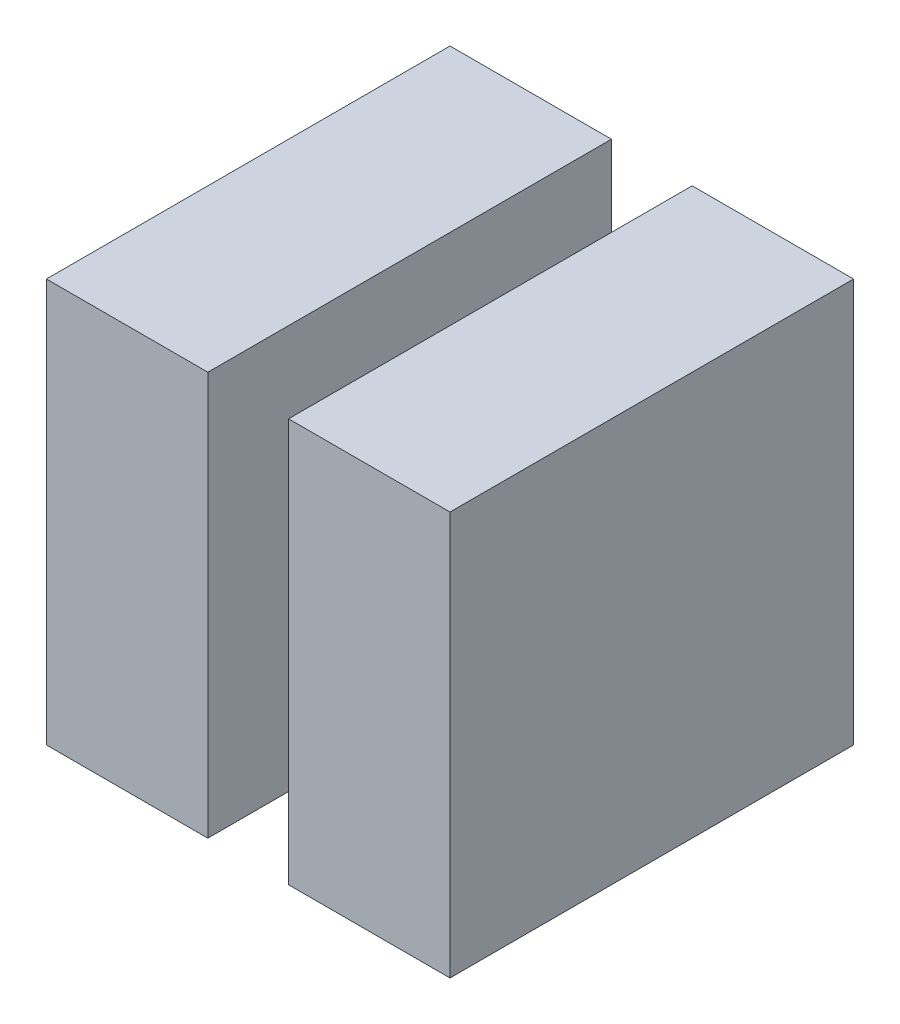
ISO-10303-21;
HEADER;
FILE_DESCRIPTION(('STEP AP214'),'2;1');
FILE_NAME('part.step','',(''),(''),'','','');
FILE_SCHEMA(('AUTOMOTIVE_DESIGN { 1 0 10303 214 1 1 1 1 }'));
ENDSEC;
DATA;
#1=APPLICATION_CONTEXT('core data for automotive mechanical design processes');
#2=APPLICATION_PROTOCOL_DEFINITION('international standard','automotive_design',2000,#1);
#3=PRODUCT_CONTEXT('',#1,'mechanical');
#4=PRODUCT('Part','Part','',(#3));
#5=PRODUCT_RELATED_PRODUCT_CATEGORY('part','',(#4));
#6=PRODUCT_DEFINITION_FORMATION('','',#4);
#7=PRODUCT_DEFINITION_CONTEXT('part definition',#1,'design');
#8=PRODUCT_DEFINITION('design','',#6,#7);
#9=PRODUCT_DEFINITION_SHAPE('','',#8);
#10=(LENGTH_UNIT() NAMED_UNIT(*) SI_UNIT(.MILLI.,.METRE.));
#11=(NAMED_UNIT(*) PLANE_ANGLE_UNIT() SI_UNIT($,.RADIAN.));
#12=(NAMED_UNIT(*) SI_UNIT($,.STERADIAN.) SOLID_ANGLE_UNIT());
#13=UNCERTAINTY_MEASURE_WITH_UNIT(LENGTH_MEASURE(1.E-05),#10,'distance_accuracy_value','');
#14=(GEOMETRIC_REPRESENTATION_CONTEXT(3) GLOBAL_UNCERTAINTY_ASSIGNED_CONTEXT((#13)) GLOBAL_UNIT_ASSIGNED_CONTEXT((#10,
#11,#12)) REPRESENTATION_CONTEXT('',''));
#15=CARTESIAN_POINT('',(0.,0.,0.));
#16=DIRECTION('',(0.,0.,1.));
#17=DIRECTION('',(1.,0.,0.));
#18=AXIS2_PLACEMENT_3D('',#15,#16,#17);
#19=CARTESIAN_POINT('',(30.,0.,50.));
#20=DIRECTION('',(1.,0.,0.));
#21=DIRECTION('',(0.,0.,-1.));
#22=AXIS2_PLACEMENT_3D('',#19,#20,#21);
#23=PLANE('',#22);
#24=DIRECTION('',(0.,-1.,0.));
#25=VECTOR('',#24,1.);
#26=CARTESIAN_POINT('',(30.,0.,0.));
#27=LINE('',#26,#25);
#28=CARTESIAN_POINT('',(30.,50.,0.));
#29=VERTEX_POINT('',#28);
#30=CARTESIAN_POINT('',(30.,0.,0.));
#31=VERTEX_POINT('',#30);
#32=EDGE_CURVE('E125',#29,#31,#27,.T.);
#33=ORIENTED_EDGE('',*,*,#32,.T.);
#34=DIRECTION('',(0.,0.,-1.));
#35=VECTOR('',#34,1.);
#36=CARTESIAN_POINT('',(30.,0.,50.));
#37=LINE('',#36,#35);
#38=CARTESIAN_POINT('',(30.,0.,50.));
#39=VERTEX_POINT('',#38);
#40=EDGE_CURVE('E12',#39,#31,#37,.T.);
#41=ORIENTED_EDGE('',*,*,#40,.F.);
#42=DIRECTION('',(0.,-1.,0.));
#43=VECTOR('',#42,1.);
#44=CARTESIAN_POINT('',(30.,0.,50.));
#45=LINE('',#44,#43);
#46=CARTESIAN_POINT('',(30.,50.,50.));
#47=VERTEX_POINT('',#46);
#48=EDGE_CURVE('E109',#47,#39,#45,.T.);
#49=ORIENTED_EDGE('',*,*,#48,.F.);
#50=DIRECTION('',(0.,0.,-1.));
#51=VECTOR('',#50,1.);
#52=CARTESIAN_POINT('',(30.,50.,50.));
#53=LINE('',#52,#51);
#54=EDGE_CURVE('E121',#47,#29,#53,.T.);
#55=ORIENTED_EDGE('',*,*,#54,.T.);
#56=EDGE_LOOP('',(#33,#41,#49,#55));
#57=FACE_BOUND('',#56,.T.);
#58=ADVANCED_FACE('F57',(#57),#23,.F.);
#59=CARTESIAN_POINT('',(30.,0.,50.));
#60=DIRECTION('',(0.,1.,0.));
#61=DIRECTION('',(0.,0.,1.));
#62=AXIS2_PLACEMENT_3D('',#59,#60,#61);
#63=PLANE('',#62);
#64=DIRECTION('',(1.,0.,0.));
#65=VECTOR('',#64,1.);
#66=CARTESIAN_POINT('',(30.,0.,0.));
#67=LINE('',#66,#65);
#68=CARTESIAN_POINT('',(50.,0.,0.));
#69=VERTEX_POINT('',#68);
#70=EDGE_CURVE('E114',#31,#69,#67,.T.);
#71=ORIENTED_EDGE('',*,*,#70,.T.);
#72=DIRECTION('',(0.,0.,-1.));
#73=VECTOR('',#72,1.);
#74=CARTESIAN_POINT('',(50.,0.,50.));
#75=LINE('',#74,#73);
#76=CARTESIAN_POINT('',(50.,0.,50.));
#77=VERTEX_POINT('',#76);
#78=EDGE_CURVE('E66',#77,#69,#75,.T.);
#79=ORIENTED_EDGE('',*,*,#78,.F.);
#80=DIRECTION('',(1.,0.,0.));
#81=VECTOR('',#80,1.);
#82=CARTESIAN_POINT('',(30.,0.,50.));
#83=LINE('',#82,#81);
#84=EDGE_CURVE('E104',#39,#77,#83,.T.);
#85=ORIENTED_EDGE('',*,*,#84,.F.);
#86=ORIENTED_EDGE('',*,*,#40,.T.);
#87=EDGE_LOOP('',(#71,#79,#85,#86));
#88=FACE_BOUND('',#87,.T.);
#89=ADVANCED_FACE('F113',(#88),#63,.F.);
#90=CARTESIAN_POINT('',(50.,0.,50.));
#91=DIRECTION('',(-1.,0.,0.));
#92=DIRECTION('',(0.,0.,1.));
#93=AXIS2_PLACEMENT_3D('',#90,#91,#92);
#94=PLANE('',#93);
#95=DIRECTION('',(0.,1.,0.));
#96=VECTOR('',#95,1.);
#97=CARTESIAN_POINT('',(50.,0.,0.));
#98=LINE('',#97,#96);
#99=CARTESIAN_POINT('',(50.,50.,0.));
#100=VERTEX_POINT('',#99);
#101=EDGE_CURVE('E91',#69,#100,#98,.T.);
#102=ORIENTED_EDGE('',*,*,#101,.T.);
#103=DIRECTION('',(0.,0.,-1.));
#104=VECTOR('',#103,1.);
#105=CARTESIAN_POINT('',(50.,50.,50.));
#106=LINE('',#105,#104);
#107=CARTESIAN_POINT('',(50.,50.,50.));
#108=VERTEX_POINT('',#107);
#109=EDGE_CURVE('E116',#108,#100,#106,.T.);
#110=ORIENTED_EDGE('',*,*,#109,.F.);
#111=DIRECTION('',(0.,1.,0.));
#112=VECTOR('',#111,1.);
#113=CARTESIAN_POINT('',(50.,0.,50.));
#114=LINE('',#113,#112);
#115=EDGE_CURVE('E107',#77,#108,#114,.T.);
#116=ORIENTED_EDGE('',*,*,#115,.F.);
#117=ORIENTED_EDGE('',*,*,#78,.T.);
#118=EDGE_LOOP('',(#102,#110,#116,#117));
#119=FACE_BOUND('',#118,.T.);
#120=ADVANCED_FACE('F117',(#119),#94,.F.);
#121=CARTESIAN_POINT('',(30.,50.,50.));
#122=DIRECTION('',(0.,-1.,0.));
#123=DIRECTION('',(0.,0.,-1.));
#124=AXIS2_PLACEMENT_3D('',#121,#122,#123);
#125=PLANE('',#124);
#126=DIRECTION('',(-1.,0.,0.));
#127=VECTOR('',#126,1.);
#128=CARTESIAN_POINT('',(30.,50.,0.));
#129=LINE('',#128,#127);
#130=EDGE_CURVE('E97',#100,#29,#129,.T.);
#131=ORIENTED_EDGE('',*,*,#130,.T.);
#132=ORIENTED_EDGE('',*,*,#54,.F.);
#133=DIRECTION('',(-1.,0.,0.));
#134=VECTOR('',#133,1.);
#135=CARTESIAN_POINT('',(30.,50.,50.));
#136=LINE('',#135,#134);
#137=EDGE_CURVE('E74',#108,#47,#136,.T.);
#138=ORIENTED_EDGE('',*,*,#137,.F.);
#139=ORIENTED_EDGE('',*,*,#109,.T.);
#140=EDGE_LOOP('',(#131,#132,#138,#139));
#141=FACE_BOUND('',#140,.T.);
#142=ADVANCED_FACE('F138',(#141),#125,.F.);
#143=CARTESIAN_POINT('',(30.,0.,50.));
#144=DIRECTION('',(0.,0.,-1.));
#145=DIRECTION('',(-1.,0.,0.));
#146=AXIS2_PLACEMENT_3D('',#143,#144,#145);
#147=PLANE('',#146);
#148=ORIENTED_EDGE('',*,*,#48,.T.);
#149=ORIENTED_EDGE('',*,*,#84,.T.);
#150=ORIENTED_EDGE('',*,*,#115,.T.);
#151=ORIENTED_EDGE('',*,*,#137,.T.);
#152=EDGE_LOOP('',(#148,#149,#150,#151));
#153=FACE_BOUND('',#152,.T.);
#154=ADVANCED_FACE('F105',(#153),#147,.F.);
#155=CARTESIAN_POINT('',(30.,0.,0.));
#156=DIRECTION('',(0.,0.,-1.));
#157=DIRECTION('',(-1.,0.,0.));
#158=AXIS2_PLACEMENT_3D('',#155,#156,#157);
#159=PLANE('',#158);
#160=ORIENTED_EDGE('',*,*,#32,.F.);
#161=ORIENTED_EDGE('',*,*,#130,.F.);
#162=ORIENTED_EDGE('',*,*,#101,.F.);
#163=ORIENTED_EDGE('',*,*,#70,.F.);
#164=EDGE_LOOP('',(#160,#161,#162,#163));
#165=FACE_BOUND('',#164,.T.);
#166=ADVANCED_FACE('F141',(#165),#159,.T.);
#167=CLOSED_SHELL('',(#58,#89,#120,#142,#154,#166));
#168=MANIFOLD_SOLID_BREP('B2',#167);
#169=CARTESIAN_POINT('',(0.,0.,50.));
#170=DIRECTION('',(1.,0.,0.));
#171=DIRECTION('',(0.,0.,-1.));
#172=AXIS2_PLACEMENT_3D('',#169,#170,#171);
#173=PLANE('',#172);
#174=DIRECTION('',(0.,-1.,0.));
#175=VECTOR('',#174,1.);
#176=CARTESIAN_POINT('',(0.,0.,0.));
#177=LINE('',#176,#175);
#178=CARTESIAN_POINT('',(0.,50.,0.));
#179=VERTEX_POINT('',#178);
#180=CARTESIAN_POINT('',(0.,0.,0.));
#181=VERTEX_POINT('',#180);
#182=EDGE_CURVE('E274',#179,#181,#177,.T.);
#183=ORIENTED_EDGE('',*,*,#182,.T.);
#184=DIRECTION('',(0.,0.,-1.));
#185=VECTOR('',#184,1.);
#186=CARTESIAN_POINT('',(0.,0.,50.));
#187=LINE('',#186,#185);
#188=CARTESIAN_POINT('',(0.,0.,50.));
#189=VERTEX_POINT('',#188);
#190=EDGE_CURVE('E55',#189,#181,#187,.T.);
#191=ORIENTED_EDGE('',*,*,#190,.F.);
#192=DIRECTION('',(0.,-1.,0.));
#193=VECTOR('',#192,1.);
#194=CARTESIAN_POINT('',(0.,0.,50.));
#195=LINE('',#194,#193);
#196=CARTESIAN_POINT('',(0.,50.,50.));
#197=VERTEX_POINT('',#196);
#198=EDGE_CURVE('E262',#197,#189,#195,.T.);
#199=ORIENTED_EDGE('',*,*,#198,.F.);
#200=DIRECTION('',(0.,0.,-1.));
#201=VECTOR('',#200,1.);
#202=CARTESIAN_POINT('',(0.,50.,50.));
#203=LINE('',#202,#201);
#204=EDGE_CURVE('E270',#197,#179,#203,.T.);
#205=ORIENTED_EDGE('',*,*,#204,.T.);
#206=EDGE_LOOP('',(#183,#191,#199,#205));
#207=FACE_BOUND('',#206,.T.);
#208=ADVANCED_FACE('F211',(#207),#173,.F.);
#209=CARTESIAN_POINT('',(0.,0.,50.));
#210=DIRECTION('',(0.,1.,0.));
#211=DIRECTION('',(0.,0.,1.));
#212=AXIS2_PLACEMENT_3D('',#209,#210,#211);
#213=PLANE('',#212);
#214=DIRECTION('',(1.,0.,0.));
#215=VECTOR('',#214,1.);
#216=CARTESIAN_POINT('',(0.,0.,0.));
#217=LINE('',#216,#215);
#218=CARTESIAN_POINT('',(20.,0.,0.));
#219=VERTEX_POINT('',#218);
#220=EDGE_CURVE('E266',#181,#219,#217,.T.);
#221=ORIENTED_EDGE('',*,*,#220,.T.);
#222=DIRECTION('',(0.,0.,-1.));
#223=VECTOR('',#222,1.);
#224=CARTESIAN_POINT('',(20.,0.,50.));
#225=LINE('',#224,#223);
#226=CARTESIAN_POINT('',(20.,0.,50.));
#227=VERTEX_POINT('',#226);
#228=EDGE_CURVE('E219',#227,#219,#225,.T.);
#229=ORIENTED_EDGE('',*,*,#228,.F.);
#230=DIRECTION('',(1.,0.,0.));
#231=VECTOR('',#230,1.);
#232=CARTESIAN_POINT('',(0.,0.,50.));
#233=LINE('',#232,#231);
#234=EDGE_CURVE('E257',#189,#227,#233,.T.);
#235=ORIENTED_EDGE('',*,*,#234,.F.);
#236=ORIENTED_EDGE('',*,*,#190,.T.);
#237=EDGE_LOOP('',(#221,#229,#235,#236));
#238=FACE_BOUND('',#237,.T.);
#239=ADVANCED_FACE('F265',(#238),#213,.F.);
#240=CARTESIAN_POINT('',(20.,0.,50.));
#241=DIRECTION('',(-1.,0.,0.));
#242=DIRECTION('',(0.,0.,1.));
#243=AXIS2_PLACEMENT_3D('',#240,#241,#242);
#244=PLANE('',#243);
#245=DIRECTION('',(0.,1.,0.));
#246=VECTOR('',#245,1.);
#247=CARTESIAN_POINT('',(20.,0.,0.));
#248=LINE('',#247,#246);
#249=CARTESIAN_POINT('',(20.,50.,0.));
#250=VERTEX_POINT('',#249);
#251=EDGE_CURVE('E244',#219,#250,#248,.T.);
#252=ORIENTED_EDGE('',*,*,#251,.T.);
#253=DIRECTION('',(0.,0.,-1.));
#254=VECTOR('',#253,1.);
#255=CARTESIAN_POINT('',(20.,50.,50.));
#256=LINE('',#255,#254);
#257=CARTESIAN_POINT('',(20.,50.,50.));
#258=VERTEX_POINT('',#257);
#259=EDGE_CURVE('E267',#258,#250,#256,.T.);
#260=ORIENTED_EDGE('',*,*,#259,.F.);
#261=DIRECTION('',(0.,1.,0.));
#262=VECTOR('',#261,1.);
#263=CARTESIAN_POINT('',(20.,0.,50.));
#264=LINE('',#263,#262);
#265=EDGE_CURVE('E260',#227,#258,#264,.T.);
#266=ORIENTED_EDGE('',*,*,#265,.F.);
#267=ORIENTED_EDGE('',*,*,#228,.T.);
#268=EDGE_LOOP('',(#252,#260,#266,#267));
#269=FACE_BOUND('',#268,.T.);
#270=ADVANCED_FACE('F268',(#269),#244,.F.);
#271=CARTESIAN_POINT('',(0.,50.,50.));
#272=DIRECTION('',(0.,-1.,0.));
#273=DIRECTION('',(0.,0.,-1.));
#274=AXIS2_PLACEMENT_3D('',#271,#272,#273);
#275=PLANE('',#274);
#276=DIRECTION('',(-1.,0.,0.));
#277=VECTOR('',#276,1.);
#278=CARTESIAN_POINT('',(0.,50.,0.));
#279=LINE('',#278,#277);
#280=EDGE_CURVE('E250',#250,#179,#279,.T.);
#281=ORIENTED_EDGE('',*,*,#280,.T.);
#282=ORIENTED_EDGE('',*,*,#204,.F.);
#283=DIRECTION('',(-1.,0.,0.));
#284=VECTOR('',#283,1.);
#285=CARTESIAN_POINT('',(0.,50.,50.));
#286=LINE('',#285,#284);
#287=EDGE_CURVE('E227',#258,#197,#286,.T.);
#288=ORIENTED_EDGE('',*,*,#287,.F.);
#289=ORIENTED_EDGE('',*,*,#259,.T.);
#290=EDGE_LOOP('',(#281,#282,#288,#289));
#291=FACE_BOUND('',#290,.T.);
#292=ADVANCED_FACE('F281',(#291),#275,.F.);
#293=CARTESIAN_POINT('',(0.,0.,50.));
#294=DIRECTION('',(0.,0.,-1.));
#295=DIRECTION('',(-1.,0.,0.));
#296=AXIS2_PLACEMENT_3D('',#293,#294,#295);
#297=PLANE('',#296);
#298=ORIENTED_EDGE('',*,*,#198,.T.);
#299=ORIENTED_EDGE('',*,*,#234,.T.);
#300=ORIENTED_EDGE('',*,*,#265,.T.);
#301=ORIENTED_EDGE('',*,*,#287,.T.);
#302=EDGE_LOOP('',(#298,#299,#300,#301));
#303=FACE_BOUND('',#302,.T.);
#304=ADVANCED_FACE('F258',(#303),#297,.F.);
#305=CARTESIAN_POINT('',(0.,0.,0.));
#306=DIRECTION('',(0.,0.,-1.));
#307=DIRECTION('',(-1.,0.,0.));
#308=AXIS2_PLACEMENT_3D('',#305,#306,#307);
#309=PLANE('',#308);
#310=ORIENTED_EDGE('',*,*,#182,.F.);
#311=ORIENTED_EDGE('',*,*,#280,.F.);
#312=ORIENTED_EDGE('',*,*,#251,.F.);
#313=ORIENTED_EDGE('',*,*,#220,.F.);
#314=EDGE_LOOP('',(#310,#311,#312,#313));
#315=FACE_BOUND('',#314,.T.);
#316=ADVANCED_FACE('F284',(#315),#309,.T.);
#317=CLOSED_SHELL('',(#208,#239,#270,#292,#304,#316));
#318=MANIFOLD_SOLID_BREP('B6',#317);
#319=ADVANCED_BREP_SHAPE_REPRESENTATION('',(#18,#168,#318),#14);
#320=SHAPE_DEFINITION_REPRESENTATION(#9,#319);
ENDSEC;
END-ISO-10303-21;
